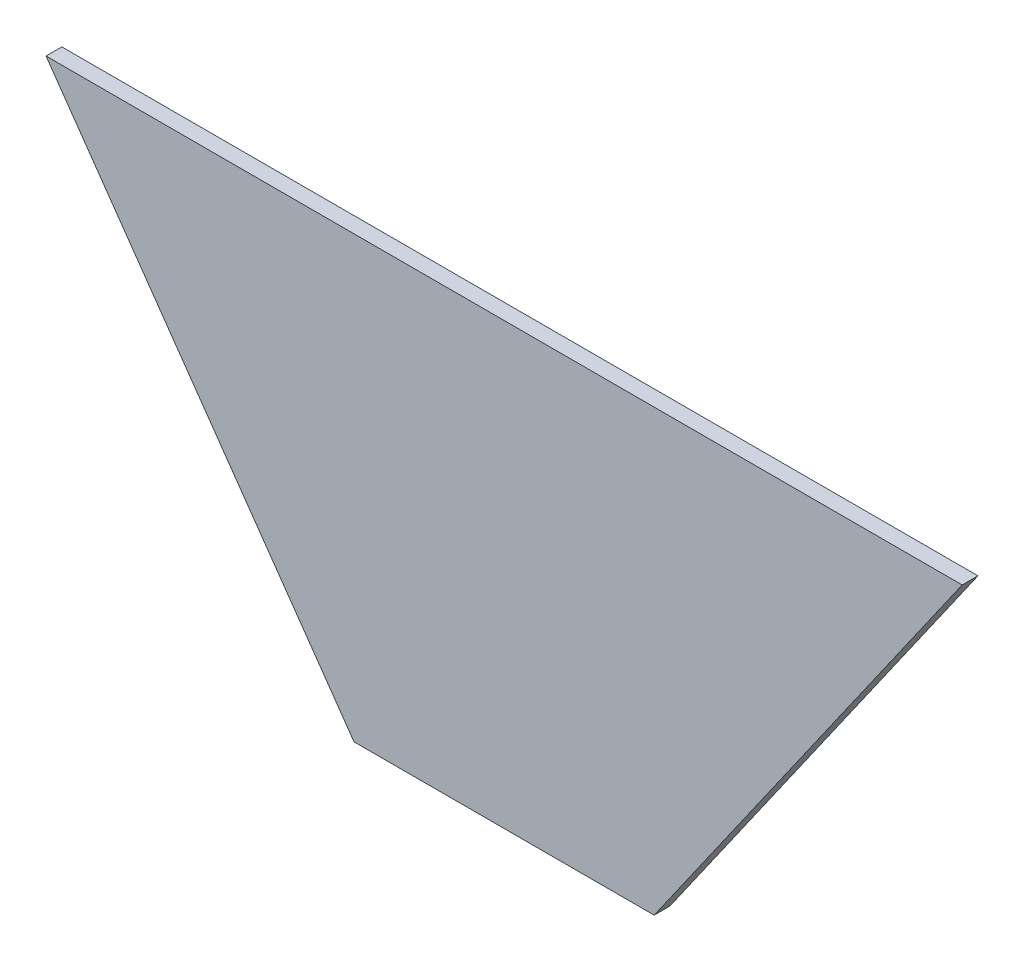
ISO-10303-21;
HEADER;
FILE_DESCRIPTION(('STEP AP214'),'2;1');
FILE_NAME('part.step','',(''),(''),'','','');
FILE_SCHEMA(('AUTOMOTIVE_DESIGN { 1 0 10303 214 1 1 1 1 }'));
ENDSEC;
DATA;
#1=APPLICATION_CONTEXT('core data for automotive mechanical design processes');
#2=APPLICATION_PROTOCOL_DEFINITION('international standard','automotive_design',2000,#1);
#3=PRODUCT_CONTEXT('',#1,'mechanical');
#4=PRODUCT('Part','Part','',(#3));
#5=PRODUCT_RELATED_PRODUCT_CATEGORY('part','',(#4));
#6=PRODUCT_DEFINITION_FORMATION('','',#4);
#7=PRODUCT_DEFINITION_CONTEXT('part definition',#1,'design');
#8=PRODUCT_DEFINITION('design','',#6,#7);
#9=PRODUCT_DEFINITION_SHAPE('','',#8);
#10=(LENGTH_UNIT() NAMED_UNIT(*) SI_UNIT(.MILLI.,.METRE.));
#11=(NAMED_UNIT(*) PLANE_ANGLE_UNIT() SI_UNIT($,.RADIAN.));
#12=(NAMED_UNIT(*) SI_UNIT($,.STERADIAN.) SOLID_ANGLE_UNIT());
#13=UNCERTAINTY_MEASURE_WITH_UNIT(LENGTH_MEASURE(1.E-05),#10,'distance_accuracy_value','');
#14=(GEOMETRIC_REPRESENTATION_CONTEXT(3) GLOBAL_UNCERTAINTY_ASSIGNED_CONTEXT((#13)) GLOBAL_UNIT_ASSIGNED_CONTEXT((#10,
#11,#12)) REPRESENTATION_CONTEXT('',''));
#15=CARTESIAN_POINT('',(0.,0.,0.));
#16=DIRECTION('',(0.,0.,1.));
#17=DIRECTION('',(1.,0.,0.));
#18=AXIS2_PLACEMENT_3D('',#15,#16,#17);
#19=CARTESIAN_POINT('',(-290.,278.522889544109,10.));
#20=DIRECTION('',(0.81918496924738,0.573529411764705,0.));
#21=DIRECTION('',(-0.573529411764706,0.81918496924738,0.));
#22=AXIS2_PLACEMENT_3D('',#19,#20,#21);
#23=PLANE('',#22);
#24=DIRECTION('',(0.573529411764705,-0.81918496924738,0.));
#25=VECTOR('',#24,1.);
#26=CARTESIAN_POINT('',(-290.,278.522889544109,0.));
#27=LINE('',#26,#25);
#28=CARTESIAN_POINT('',(-290.,278.522889544109,0.));
#29=VERTEX_POINT('',#28);
#30=CARTESIAN_POINT('',(-95.,0.,0.));
#31=VERTEX_POINT('',#30);
#32=EDGE_CURVE('E107',#29,#31,#27,.T.);
#33=ORIENTED_EDGE('',*,*,#32,.T.);
#34=DIRECTION('',(0.,0.,-1.));
#35=VECTOR('',#34,1.);
#36=CARTESIAN_POINT('',(-95.,0.,10.));
#37=LINE('',#36,#35);
#38=CARTESIAN_POINT('',(-95.,0.,10.));
#39=VERTEX_POINT('',#38);
#40=EDGE_CURVE('E11',#39,#31,#37,.T.);
#41=ORIENTED_EDGE('',*,*,#40,.F.);
#42=DIRECTION('',(0.573529411764705,-0.81918496924738,0.));
#43=VECTOR('',#42,1.);
#44=CARTESIAN_POINT('',(-290.,278.522889544109,10.));
#45=LINE('',#44,#43);
#46=CARTESIAN_POINT('',(-290.,278.522889544109,10.));
#47=VERTEX_POINT('',#46);
#48=EDGE_CURVE('E91',#47,#39,#45,.T.);
#49=ORIENTED_EDGE('',*,*,#48,.F.);
#50=DIRECTION('',(0.,0.,-1.));
#51=VECTOR('',#50,1.);
#52=CARTESIAN_POINT('',(-290.,278.522889544109,10.));
#53=LINE('',#52,#51);
#54=EDGE_CURVE('E103',#47,#29,#53,.T.);
#55=ORIENTED_EDGE('',*,*,#54,.T.);
#56=EDGE_LOOP('',(#33,#41,#49,#55));
#57=FACE_BOUND('',#56,.T.);
#58=ADVANCED_FACE('F39',(#57),#23,.F.);
#59=CARTESIAN_POINT('',(-95.,0.,10.));
#60=DIRECTION('',(0.,1.,0.));
#61=DIRECTION('',(0.,0.,1.));
#62=AXIS2_PLACEMENT_3D('',#59,#60,#61);
#63=PLANE('',#62);
#64=DIRECTION('',(1.,0.,0.));
#65=VECTOR('',#64,1.);
#66=CARTESIAN_POINT('',(-95.,0.,0.));
#67=LINE('',#66,#65);
#68=CARTESIAN_POINT('',(95.,0.,0.));
#69=VERTEX_POINT('',#68);
#70=EDGE_CURVE('E96',#31,#69,#67,.T.);
#71=ORIENTED_EDGE('',*,*,#70,.T.);
#72=DIRECTION('',(0.,0.,-1.));
#73=VECTOR('',#72,1.);
#74=CARTESIAN_POINT('',(95.,0.,10.));
#75=LINE('',#74,#73);
#76=CARTESIAN_POINT('',(95.,0.,10.));
#77=VERTEX_POINT('',#76);
#78=EDGE_CURVE('E48',#77,#69,#75,.T.);
#79=ORIENTED_EDGE('',*,*,#78,.F.);
#80=DIRECTION('',(1.,0.,0.));
#81=VECTOR('',#80,1.);
#82=CARTESIAN_POINT('',(-95.,0.,10.));
#83=LINE('',#82,#81);
#84=EDGE_CURVE('E86',#39,#77,#83,.T.);
#85=ORIENTED_EDGE('',*,*,#84,.F.);
#86=ORIENTED_EDGE('',*,*,#40,.T.);
#87=EDGE_LOOP('',(#71,#79,#85,#86));
#88=FACE_BOUND('',#87,.T.);
#89=ADVANCED_FACE('F95',(#88),#63,.F.);
#90=CARTESIAN_POINT('',(95.,0.,10.));
#91=DIRECTION('',(-0.819184969247379,0.573529411764706,0.));
#92=DIRECTION('',(-0.573529411764706,-0.819184969247379,0.));
#93=AXIS2_PLACEMENT_3D('',#90,#91,#92);
#94=PLANE('',#93);
#95=DIRECTION('',(0.573529411764706,0.819184969247379,0.));
#96=VECTOR('',#95,1.);
#97=CARTESIAN_POINT('',(95.,0.,0.));
#98=LINE('',#97,#96);
#99=CARTESIAN_POINT('',(290.,278.522889544109,0.));
#100=VERTEX_POINT('',#99);
#101=EDGE_CURVE('E73',#69,#100,#98,.T.);
#102=ORIENTED_EDGE('',*,*,#101,.T.);
#103=DIRECTION('',(0.,0.,-1.));
#104=VECTOR('',#103,1.);
#105=CARTESIAN_POINT('',(290.,278.522889544109,10.));
#106=LINE('',#105,#104);
#107=CARTESIAN_POINT('',(290.,278.522889544109,10.));
#108=VERTEX_POINT('',#107);
#109=EDGE_CURVE('E98',#108,#100,#106,.T.);
#110=ORIENTED_EDGE('',*,*,#109,.F.);
#111=DIRECTION('',(0.573529411764706,0.819184969247379,0.));
#112=VECTOR('',#111,1.);
#113=CARTESIAN_POINT('',(95.,0.,10.));
#114=LINE('',#113,#112);
#115=EDGE_CURVE('E89',#77,#108,#114,.T.);
#116=ORIENTED_EDGE('',*,*,#115,.F.);
#117=ORIENTED_EDGE('',*,*,#78,.T.);
#118=EDGE_LOOP('',(#102,#110,#116,#117));
#119=FACE_BOUND('',#118,.T.);
#120=ADVANCED_FACE('F99',(#119),#94,.F.);
#121=CARTESIAN_POINT('',(290.,278.522889544109,10.));
#122=DIRECTION('',(0.,-1.,0.));
#123=DIRECTION('',(1.,0.,0.));
#124=AXIS2_PLACEMENT_3D('',#121,#122,#123);
#125=PLANE('',#124);
#126=DIRECTION('',(-1.,0.,0.));
#127=VECTOR('',#126,1.);
#128=CARTESIAN_POINT('',(290.,278.522889544109,0.));
#129=LINE('',#128,#127);
#130=EDGE_CURVE('E79',#100,#29,#129,.T.);
#131=ORIENTED_EDGE('',*,*,#130,.T.);
#132=ORIENTED_EDGE('',*,*,#54,.F.);
#133=DIRECTION('',(-1.,0.,0.));
#134=VECTOR('',#133,1.);
#135=CARTESIAN_POINT('',(290.,278.522889544109,10.));
#136=LINE('',#135,#134);
#137=EDGE_CURVE('E56',#108,#47,#136,.T.);
#138=ORIENTED_EDGE('',*,*,#137,.F.);
#139=ORIENTED_EDGE('',*,*,#109,.T.);
#140=EDGE_LOOP('',(#131,#132,#138,#139));
#141=FACE_BOUND('',#140,.T.);
#142=ADVANCED_FACE('F120',(#141),#125,.F.);
#143=CARTESIAN_POINT('',(0.,0.,10.));
#144=DIRECTION('',(0.,0.,1.));
#145=DIRECTION('',(1.,0.,0.));
#146=AXIS2_PLACEMENT_3D('',#143,#144,#145);
#147=PLANE('',#146);
#148=ORIENTED_EDGE('',*,*,#48,.T.);
#149=ORIENTED_EDGE('',*,*,#84,.T.);
#150=ORIENTED_EDGE('',*,*,#115,.T.);
#151=ORIENTED_EDGE('',*,*,#137,.T.);
#152=EDGE_LOOP('',(#148,#149,#150,#151));
#153=FACE_BOUND('',#152,.T.);
#154=ADVANCED_FACE('F87',(#153),#147,.T.);
#155=CARTESIAN_POINT('',(0.,0.,0.));
#156=DIRECTION('',(0.,0.,1.));
#157=DIRECTION('',(1.,0.,0.));
#158=AXIS2_PLACEMENT_3D('',#155,#156,#157);
#159=PLANE('',#158);
#160=ORIENTED_EDGE('',*,*,#32,.F.);
#161=ORIENTED_EDGE('',*,*,#130,.F.);
#162=ORIENTED_EDGE('',*,*,#101,.F.);
#163=ORIENTED_EDGE('',*,*,#70,.F.);
#164=EDGE_LOOP('',(#160,#161,#162,#163));
#165=FACE_BOUND('',#164,.T.);
#166=ADVANCED_FACE('F123',(#165),#159,.F.);
#167=CLOSED_SHELL('',(#58,#89,#120,#142,#154,#166));
#168=MANIFOLD_SOLID_BREP('B2',#167);
#169=ADVANCED_BREP_SHAPE_REPRESENTATION('',(#18,#168),#14);
#170=SHAPE_DEFINITION_REPRESENTATION(#9,#169);
ENDSEC;
END-ISO-10303-21;
